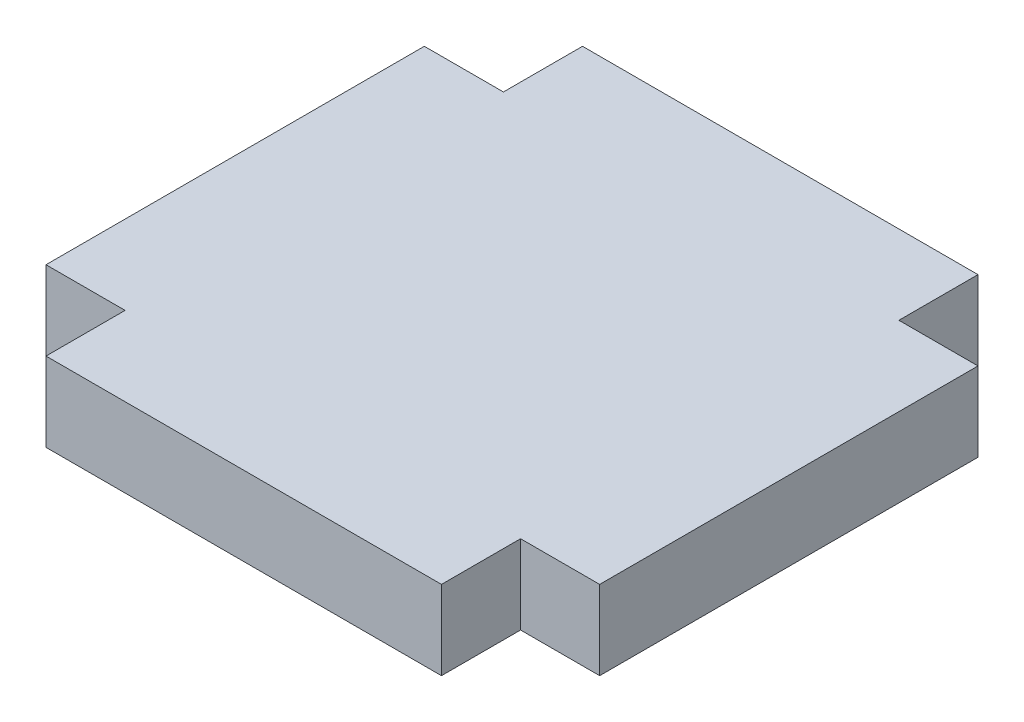
ISO-10303-21;
HEADER;
FILE_DESCRIPTION(('STEP AP214'),'2;1');
FILE_NAME('part.step','',(''),(''),'','','');
FILE_SCHEMA(('AUTOMOTIVE_DESIGN { 1 0 10303 214 1 1 1 1 }'));
ENDSEC;
DATA;
#1=APPLICATION_CONTEXT('core data for automotive mechanical design processes');
#2=APPLICATION_PROTOCOL_DEFINITION('international standard','automotive_design',2000,#1);
#3=PRODUCT_CONTEXT('',#1,'mechanical');
#4=PRODUCT('Part','Part','',(#3));
#5=PRODUCT_RELATED_PRODUCT_CATEGORY('part','',(#4));
#6=PRODUCT_DEFINITION_FORMATION('','',#4);
#7=PRODUCT_DEFINITION_CONTEXT('part definition',#1,'design');
#8=PRODUCT_DEFINITION('design','',#6,#7);
#9=PRODUCT_DEFINITION_SHAPE('','',#8);
#10=(LENGTH_UNIT() NAMED_UNIT(*) SI_UNIT(.MILLI.,.METRE.));
#11=(NAMED_UNIT(*) PLANE_ANGLE_UNIT() SI_UNIT($,.RADIAN.));
#12=(NAMED_UNIT(*) SI_UNIT($,.STERADIAN.) SOLID_ANGLE_UNIT());
#13=UNCERTAINTY_MEASURE_WITH_UNIT(LENGTH_MEASURE(1.E-05),#10,'distance_accuracy_value','');
#14=(GEOMETRIC_REPRESENTATION_CONTEXT(3) GLOBAL_UNCERTAINTY_ASSIGNED_CONTEXT((#13)) GLOBAL_UNIT_ASSIGNED_CONTEXT((#10,
#11,#12)) REPRESENTATION_CONTEXT('',''));
#15=CARTESIAN_POINT('',(0.,0.,0.));
#16=DIRECTION('',(0.,0.,1.));
#17=DIRECTION('',(1.,0.,0.));
#18=AXIS2_PLACEMENT_3D('',#15,#16,#17);
#19=CARTESIAN_POINT('',(-7.5,1.5,-7.175));
#20=DIRECTION('',(1.,0.,0.));
#21=DIRECTION('',(0.,0.,-1.));
#22=AXIS2_PLACEMENT_3D('',#19,#20,#21);
#23=PLANE('',#22);
#24=DIRECTION('',(0.,0.,1.));
#25=VECTOR('',#24,1.);
#26=CARTESIAN_POINT('',(-7.5,-1.5,-7.175));
#27=LINE('',#26,#25);
#28=CARTESIAN_POINT('',(-7.5,-1.5,-10.175));
#29=VERTEX_POINT('',#28);
#30=CARTESIAN_POINT('',(-7.5,-1.5,-7.175));
#31=VERTEX_POINT('',#30);
#32=EDGE_CURVE('E159',#29,#31,#27,.T.);
#33=ORIENTED_EDGE('',*,*,#32,.T.);
#34=DIRECTION('',(0.,-1.,0.));
#35=VECTOR('',#34,1.);
#36=CARTESIAN_POINT('',(-7.5,1.5,-7.175));
#37=LINE('',#36,#35);
#38=CARTESIAN_POINT('',(-7.5,1.5,-7.175));
#39=VERTEX_POINT('',#38);
#40=EDGE_CURVE('E11',#39,#31,#37,.T.);
#41=ORIENTED_EDGE('',*,*,#40,.F.);
#42=DIRECTION('',(0.,0.,1.));
#43=VECTOR('',#42,1.);
#44=CARTESIAN_POINT('',(-7.5,1.5,-7.175));
#45=LINE('',#44,#43);
#46=CARTESIAN_POINT('',(-7.5,1.5,-10.175));
#47=VERTEX_POINT('',#46);
#48=EDGE_CURVE('E181',#47,#39,#45,.T.);
#49=ORIENTED_EDGE('',*,*,#48,.F.);
#50=DIRECTION('',(0.,-1.,0.));
#51=VECTOR('',#50,1.);
#52=CARTESIAN_POINT('',(-7.5,1.5,-10.175));
#53=LINE('',#52,#51);
#54=EDGE_CURVE('E155',#47,#29,#53,.T.);
#55=ORIENTED_EDGE('',*,*,#54,.T.);
#56=EDGE_LOOP('',(#33,#41,#49,#55));
#57=FACE_BOUND('',#56,.T.);
#58=ADVANCED_FACE('F39',(#57),#23,.F.);
#59=CARTESIAN_POINT('',(-10.5,1.5,-7.175));
#60=DIRECTION('',(0.,0.,1.));
#61=DIRECTION('',(1.,0.,0.));
#62=AXIS2_PLACEMENT_3D('',#59,#60,#61);
#63=PLANE('',#62);
#64=DIRECTION('',(-1.,0.,0.));
#65=VECTOR('',#64,1.);
#66=CARTESIAN_POINT('',(-10.5,-1.5,-7.175));
#67=LINE('',#66,#65);
#68=CARTESIAN_POINT('',(-10.5,-1.5,-7.175));
#69=VERTEX_POINT('',#68);
#70=EDGE_CURVE('E162',#31,#69,#67,.T.);
#71=ORIENTED_EDGE('',*,*,#70,.T.);
#72=DIRECTION('',(0.,-1.,0.));
#73=VECTOR('',#72,1.);
#74=CARTESIAN_POINT('',(-10.5,1.5,-7.175));
#75=LINE('',#74,#73);
#76=CARTESIAN_POINT('',(-10.5,1.5,-7.175));
#77=VERTEX_POINT('',#76);
#78=EDGE_CURVE('E47',#77,#69,#75,.T.);
#79=ORIENTED_EDGE('',*,*,#78,.F.);
#80=DIRECTION('',(-1.,0.,0.));
#81=VECTOR('',#80,1.);
#82=CARTESIAN_POINT('',(-10.5,1.5,-7.175));
#83=LINE('',#82,#81);
#84=EDGE_CURVE('E110',#39,#77,#83,.T.);
#85=ORIENTED_EDGE('',*,*,#84,.F.);
#86=ORIENTED_EDGE('',*,*,#40,.T.);
#87=EDGE_LOOP('',(#71,#79,#85,#86));
#88=FACE_BOUND('',#87,.T.);
#89=ADVANCED_FACE('F259',(#88),#63,.F.);
#90=CARTESIAN_POINT('',(-10.5,1.5,7.175));
#91=DIRECTION('',(1.,0.,0.));
#92=DIRECTION('',(0.,0.,-1.));
#93=AXIS2_PLACEMENT_3D('',#90,#91,#92);
#94=PLANE('',#93);
#95=DIRECTION('',(0.,0.,1.));
#96=VECTOR('',#95,1.);
#97=CARTESIAN_POINT('',(-10.5,-1.5,7.175));
#98=LINE('',#97,#96);
#99=CARTESIAN_POINT('',(-10.5,-1.5,7.175));
#100=VERTEX_POINT('',#99);
#101=EDGE_CURVE('E164',#69,#100,#98,.T.);
#102=ORIENTED_EDGE('',*,*,#101,.T.);
#103=DIRECTION('',(0.,-1.,0.));
#104=VECTOR('',#103,1.);
#105=CARTESIAN_POINT('',(-10.5,1.5,7.175));
#106=LINE('',#105,#104);
#107=CARTESIAN_POINT('',(-10.5,1.5,7.175));
#108=VERTEX_POINT('',#107);
#109=EDGE_CURVE('E200',#108,#100,#106,.T.);
#110=ORIENTED_EDGE('',*,*,#109,.F.);
#111=DIRECTION('',(0.,0.,1.));
#112=VECTOR('',#111,1.);
#113=CARTESIAN_POINT('',(-10.5,1.5,7.175));
#114=LINE('',#113,#112);
#115=EDGE_CURVE('E208',#77,#108,#114,.T.);
#116=ORIENTED_EDGE('',*,*,#115,.F.);
#117=ORIENTED_EDGE('',*,*,#78,.T.);
#118=EDGE_LOOP('',(#102,#110,#116,#117));
#119=FACE_BOUND('',#118,.T.);
#120=ADVANCED_FACE('F206',(#119),#94,.F.);
#121=CARTESIAN_POINT('',(-7.5,1.5,7.175));
#122=DIRECTION('',(0.,0.,-1.));
#123=DIRECTION('',(-1.,0.,0.));
#124=AXIS2_PLACEMENT_3D('',#121,#122,#123);
#125=PLANE('',#124);
#126=DIRECTION('',(1.,0.,0.));
#127=VECTOR('',#126,1.);
#128=CARTESIAN_POINT('',(-7.5,-1.5,7.175));
#129=LINE('',#128,#127);
#130=CARTESIAN_POINT('',(-7.5,-1.5,7.175));
#131=VERTEX_POINT('',#130);
#132=EDGE_CURVE('E166',#100,#131,#129,.T.);
#133=ORIENTED_EDGE('',*,*,#132,.T.);
#134=DIRECTION('',(0.,-1.,0.));
#135=VECTOR('',#134,1.);
#136=CARTESIAN_POINT('',(-7.5,1.5,7.175));
#137=LINE('',#136,#135);
#138=CARTESIAN_POINT('',(-7.5,1.5,7.175));
#139=VERTEX_POINT('',#138);
#140=EDGE_CURVE('E197',#139,#131,#137,.T.);
#141=ORIENTED_EDGE('',*,*,#140,.F.);
#142=DIRECTION('',(1.,0.,0.));
#143=VECTOR('',#142,1.);
#144=CARTESIAN_POINT('',(-7.5,1.5,7.175));
#145=LINE('',#144,#143);
#146=EDGE_CURVE('E226',#108,#139,#145,.T.);
#147=ORIENTED_EDGE('',*,*,#146,.F.);
#148=ORIENTED_EDGE('',*,*,#109,.T.);
#149=EDGE_LOOP('',(#133,#141,#147,#148));
#150=FACE_BOUND('',#149,.T.);
#151=ADVANCED_FACE('F217',(#150),#125,.F.);
#152=CARTESIAN_POINT('',(-7.5,1.5,10.175));
#153=DIRECTION('',(1.,0.,0.));
#154=DIRECTION('',(0.,0.,-1.));
#155=AXIS2_PLACEMENT_3D('',#152,#153,#154);
#156=PLANE('',#155);
#157=DIRECTION('',(0.,0.,1.));
#158=VECTOR('',#157,1.);
#159=CARTESIAN_POINT('',(-7.5,-1.5,10.175));
#160=LINE('',#159,#158);
#161=CARTESIAN_POINT('',(-7.5,-1.5,10.175));
#162=VERTEX_POINT('',#161);
#163=EDGE_CURVE('E168',#131,#162,#160,.T.);
#164=ORIENTED_EDGE('',*,*,#163,.T.);
#165=DIRECTION('',(0.,-1.,0.));
#166=VECTOR('',#165,1.);
#167=CARTESIAN_POINT('',(-7.5,1.5,10.175));
#168=LINE('',#167,#166);
#169=CARTESIAN_POINT('',(-7.5,1.5,10.175));
#170=VERTEX_POINT('',#169);
#171=EDGE_CURVE('E194',#170,#162,#168,.T.);
#172=ORIENTED_EDGE('',*,*,#171,.F.);
#173=DIRECTION('',(0.,0.,1.));
#174=VECTOR('',#173,1.);
#175=CARTESIAN_POINT('',(-7.5,1.5,10.175));
#176=LINE('',#175,#174);
#177=EDGE_CURVE('E223',#139,#170,#176,.T.);
#178=ORIENTED_EDGE('',*,*,#177,.F.);
#179=ORIENTED_EDGE('',*,*,#140,.T.);
#180=EDGE_LOOP('',(#164,#172,#178,#179));
#181=FACE_BOUND('',#180,.T.);
#182=ADVANCED_FACE('F221',(#181),#156,.F.);
#183=CARTESIAN_POINT('',(7.5,1.5,10.175));
#184=DIRECTION('',(0.,0.,-1.));
#185=DIRECTION('',(-1.,0.,0.));
#186=AXIS2_PLACEMENT_3D('',#183,#184,#185);
#187=PLANE('',#186);
#188=DIRECTION('',(1.,0.,0.));
#189=VECTOR('',#188,1.);
#190=CARTESIAN_POINT('',(7.5,-1.5,10.175));
#191=LINE('',#190,#189);
#192=CARTESIAN_POINT('',(7.5,-1.5,10.175));
#193=VERTEX_POINT('',#192);
#194=EDGE_CURVE('E170',#162,#193,#191,.T.);
#195=ORIENTED_EDGE('',*,*,#194,.T.);
#196=DIRECTION('',(0.,-1.,0.));
#197=VECTOR('',#196,1.);
#198=CARTESIAN_POINT('',(7.5,1.5,10.175));
#199=LINE('',#198,#197);
#200=CARTESIAN_POINT('',(7.5,1.5,10.175));
#201=VERTEX_POINT('',#200);
#202=EDGE_CURVE('E191',#201,#193,#199,.T.);
#203=ORIENTED_EDGE('',*,*,#202,.F.);
#204=DIRECTION('',(1.,0.,0.));
#205=VECTOR('',#204,1.);
#206=CARTESIAN_POINT('',(7.5,1.5,10.175));
#207=LINE('',#206,#205);
#208=EDGE_CURVE('E225',#170,#201,#207,.T.);
#209=ORIENTED_EDGE('',*,*,#208,.F.);
#210=ORIENTED_EDGE('',*,*,#171,.T.);
#211=EDGE_LOOP('',(#195,#203,#209,#210));
#212=FACE_BOUND('',#211,.T.);
#213=ADVANCED_FACE('F272',(#212),#187,.F.);
#214=CARTESIAN_POINT('',(7.5,1.5,7.175));
#215=DIRECTION('',(-1.,0.,0.));
#216=DIRECTION('',(0.,0.,1.));
#217=AXIS2_PLACEMENT_3D('',#214,#215,#216);
#218=PLANE('',#217);
#219=DIRECTION('',(0.,0.,-1.));
#220=VECTOR('',#219,1.);
#221=CARTESIAN_POINT('',(7.5,-1.5,7.175));
#222=LINE('',#221,#220);
#223=CARTESIAN_POINT('',(7.5,-1.5,7.175));
#224=VERTEX_POINT('',#223);
#225=EDGE_CURVE('E172',#193,#224,#222,.T.);
#226=ORIENTED_EDGE('',*,*,#225,.T.);
#227=DIRECTION('',(0.,-1.,0.));
#228=VECTOR('',#227,1.);
#229=CARTESIAN_POINT('',(7.5,1.5,7.175));
#230=LINE('',#229,#228);
#231=CARTESIAN_POINT('',(7.5,1.5,7.175));
#232=VERTEX_POINT('',#231);
#233=EDGE_CURVE('E188',#232,#224,#230,.T.);
#234=ORIENTED_EDGE('',*,*,#233,.F.);
#235=DIRECTION('',(0.,0.,-1.));
#236=VECTOR('',#235,1.);
#237=CARTESIAN_POINT('',(7.5,1.5,7.175));
#238=LINE('',#237,#236);
#239=EDGE_CURVE('E228',#201,#232,#238,.T.);
#240=ORIENTED_EDGE('',*,*,#239,.F.);
#241=ORIENTED_EDGE('',*,*,#202,.T.);
#242=EDGE_LOOP('',(#226,#234,#240,#241));
#243=FACE_BOUND('',#242,.T.);
#244=ADVANCED_FACE('F275',(#243),#218,.F.);
#245=CARTESIAN_POINT('',(10.5,1.5,7.175));
#246=DIRECTION('',(0.,0.,-1.));
#247=DIRECTION('',(-1.,0.,0.));
#248=AXIS2_PLACEMENT_3D('',#245,#246,#247);
#249=PLANE('',#248);
#250=DIRECTION('',(1.,0.,0.));
#251=VECTOR('',#250,1.);
#252=CARTESIAN_POINT('',(10.5,-1.5,7.175));
#253=LINE('',#252,#251);
#254=CARTESIAN_POINT('',(10.5,-1.5,7.175));
#255=VERTEX_POINT('',#254);
#256=EDGE_CURVE('E174',#224,#255,#253,.T.);
#257=ORIENTED_EDGE('',*,*,#256,.T.);
#258=DIRECTION('',(0.,-1.,0.));
#259=VECTOR('',#258,1.);
#260=CARTESIAN_POINT('',(10.5,1.5,7.175));
#261=LINE('',#260,#259);
#262=CARTESIAN_POINT('',(10.5,1.5,7.175));
#263=VERTEX_POINT('',#262);
#264=EDGE_CURVE('E185',#263,#255,#261,.T.);
#265=ORIENTED_EDGE('',*,*,#264,.F.);
#266=DIRECTION('',(1.,0.,0.));
#267=VECTOR('',#266,1.);
#268=CARTESIAN_POINT('',(10.5,1.5,7.175));
#269=LINE('',#268,#267);
#270=EDGE_CURVE('E234',#232,#263,#269,.T.);
#271=ORIENTED_EDGE('',*,*,#270,.F.);
#272=ORIENTED_EDGE('',*,*,#233,.T.);
#273=EDGE_LOOP('',(#257,#265,#271,#272));
#274=FACE_BOUND('',#273,.T.);
#275=ADVANCED_FACE('F240',(#274),#249,.F.);
#276=CARTESIAN_POINT('',(10.5,1.5,-7.175));
#277=DIRECTION('',(-1.,0.,0.));
#278=DIRECTION('',(0.,0.,1.));
#279=AXIS2_PLACEMENT_3D('',#276,#277,#278);
#280=PLANE('',#279);
#281=DIRECTION('',(0.,0.,-1.));
#282=VECTOR('',#281,1.);
#283=CARTESIAN_POINT('',(10.5,-1.5,-7.175));
#284=LINE('',#283,#282);
#285=CARTESIAN_POINT('',(10.5,-1.5,-7.175));
#286=VERTEX_POINT('',#285);
#287=EDGE_CURVE('E176',#255,#286,#284,.T.);
#288=ORIENTED_EDGE('',*,*,#287,.T.);
#289=DIRECTION('',(0.,-1.,0.));
#290=VECTOR('',#289,1.);
#291=CARTESIAN_POINT('',(10.5,1.5,-7.175));
#292=LINE('',#291,#290);
#293=CARTESIAN_POINT('',(10.5,1.5,-7.175));
#294=VERTEX_POINT('',#293);
#295=EDGE_CURVE('E150',#294,#286,#292,.T.);
#296=ORIENTED_EDGE('',*,*,#295,.F.);
#297=DIRECTION('',(0.,0.,-1.));
#298=VECTOR('',#297,1.);
#299=CARTESIAN_POINT('',(10.5,1.5,-7.175));
#300=LINE('',#299,#298);
#301=EDGE_CURVE('E141',#263,#294,#300,.T.);
#302=ORIENTED_EDGE('',*,*,#301,.F.);
#303=ORIENTED_EDGE('',*,*,#264,.T.);
#304=EDGE_LOOP('',(#288,#296,#302,#303));
#305=FACE_BOUND('',#304,.T.);
#306=ADVANCED_FACE('F244',(#305),#280,.F.);
#307=CARTESIAN_POINT('',(7.5,1.5,-7.175));
#308=DIRECTION('',(0.,0.,1.));
#309=DIRECTION('',(1.,0.,0.));
#310=AXIS2_PLACEMENT_3D('',#307,#308,#309);
#311=PLANE('',#310);
#312=DIRECTION('',(-1.,0.,0.));
#313=VECTOR('',#312,1.);
#314=CARTESIAN_POINT('',(7.5,-1.5,-7.175));
#315=LINE('',#314,#313);
#316=CARTESIAN_POINT('',(7.5,-1.5,-7.175));
#317=VERTEX_POINT('',#316);
#318=EDGE_CURVE('E149',#286,#317,#315,.T.);
#319=ORIENTED_EDGE('',*,*,#318,.T.);
#320=DIRECTION('',(0.,-1.,0.));
#321=VECTOR('',#320,1.);
#322=CARTESIAN_POINT('',(7.5,1.5,-7.175));
#323=LINE('',#322,#321);
#324=CARTESIAN_POINT('',(7.5,1.5,-7.175));
#325=VERTEX_POINT('',#324);
#326=EDGE_CURVE('E146',#325,#317,#323,.T.);
#327=ORIENTED_EDGE('',*,*,#326,.F.);
#328=DIRECTION('',(-1.,0.,0.));
#329=VECTOR('',#328,1.);
#330=CARTESIAN_POINT('',(7.5,1.5,-7.175));
#331=LINE('',#330,#329);
#332=EDGE_CURVE('E135',#294,#325,#331,.T.);
#333=ORIENTED_EDGE('',*,*,#332,.F.);
#334=ORIENTED_EDGE('',*,*,#295,.T.);
#335=EDGE_LOOP('',(#319,#327,#333,#334));
#336=FACE_BOUND('',#335,.T.);
#337=ADVANCED_FACE('F147',(#336),#311,.F.);
#338=CARTESIAN_POINT('',(7.5,1.5,-10.175));
#339=DIRECTION('',(-1.,0.,0.));
#340=DIRECTION('',(0.,0.,1.));
#341=AXIS2_PLACEMENT_3D('',#338,#339,#340);
#342=PLANE('',#341);
#343=DIRECTION('',(0.,0.,-1.));
#344=VECTOR('',#343,1.);
#345=CARTESIAN_POINT('',(7.5,-1.5,-10.175));
#346=LINE('',#345,#344);
#347=CARTESIAN_POINT('',(7.5,-1.5,-10.175));
#348=VERTEX_POINT('',#347);
#349=EDGE_CURVE('E96',#317,#348,#346,.T.);
#350=ORIENTED_EDGE('',*,*,#349,.T.);
#351=DIRECTION('',(0.,-1.,0.));
#352=VECTOR('',#351,1.);
#353=CARTESIAN_POINT('',(7.5,1.5,-10.175));
#354=LINE('',#353,#352);
#355=CARTESIAN_POINT('',(7.5,1.5,-10.175));
#356=VERTEX_POINT('',#355);
#357=EDGE_CURVE('E151',#356,#348,#354,.T.);
#358=ORIENTED_EDGE('',*,*,#357,.F.);
#359=DIRECTION('',(0.,0.,-1.));
#360=VECTOR('',#359,1.);
#361=CARTESIAN_POINT('',(7.5,1.5,-10.175));
#362=LINE('',#361,#360);
#363=EDGE_CURVE('E139',#325,#356,#362,.T.);
#364=ORIENTED_EDGE('',*,*,#363,.F.);
#365=ORIENTED_EDGE('',*,*,#326,.T.);
#366=EDGE_LOOP('',(#350,#358,#364,#365));
#367=FACE_BOUND('',#366,.T.);
#368=ADVANCED_FACE('F153',(#367),#342,.F.);
#369=CARTESIAN_POINT('',(-7.5,1.5,-10.175));
#370=DIRECTION('',(0.,0.,1.));
#371=DIRECTION('',(1.,0.,0.));
#372=AXIS2_PLACEMENT_3D('',#369,#370,#371);
#373=PLANE('',#372);
#374=DIRECTION('',(-1.,0.,0.));
#375=VECTOR('',#374,1.);
#376=CARTESIAN_POINT('',(-7.5,-1.5,-10.175));
#377=LINE('',#376,#375);
#378=EDGE_CURVE('E102',#348,#29,#377,.T.);
#379=ORIENTED_EDGE('',*,*,#378,.T.);
#380=ORIENTED_EDGE('',*,*,#54,.F.);
#381=DIRECTION('',(-1.,0.,0.));
#382=VECTOR('',#381,1.);
#383=CARTESIAN_POINT('',(-7.5,1.5,-10.175));
#384=LINE('',#383,#382);
#385=EDGE_CURVE('E55',#356,#47,#384,.T.);
#386=ORIENTED_EDGE('',*,*,#385,.F.);
#387=ORIENTED_EDGE('',*,*,#357,.T.);
#388=EDGE_LOOP('',(#379,#380,#386,#387));
#389=FACE_BOUND('',#388,.T.);
#390=ADVANCED_FACE('F248',(#389),#373,.F.);
#391=CARTESIAN_POINT('',(0.,1.5,0.));
#392=DIRECTION('',(0.,-1.,0.));
#393=DIRECTION('',(0.,0.,-1.));
#394=AXIS2_PLACEMENT_3D('',#391,#392,#393);
#395=PLANE('',#394);
#396=ORIENTED_EDGE('',*,*,#48,.T.);
#397=ORIENTED_EDGE('',*,*,#84,.T.);
#398=ORIENTED_EDGE('',*,*,#115,.T.);
#399=ORIENTED_EDGE('',*,*,#146,.T.);
#400=ORIENTED_EDGE('',*,*,#177,.T.);
#401=ORIENTED_EDGE('',*,*,#208,.T.);
#402=ORIENTED_EDGE('',*,*,#239,.T.);
#403=ORIENTED_EDGE('',*,*,#270,.T.);
#404=ORIENTED_EDGE('',*,*,#301,.T.);
#405=ORIENTED_EDGE('',*,*,#332,.T.);
#406=ORIENTED_EDGE('',*,*,#363,.T.);
#407=ORIENTED_EDGE('',*,*,#385,.T.);
#408=EDGE_LOOP('',(#396,#397,#398,#399,#400,#401,#402,#403,#404,#405,#406,#407));
#409=FACE_BOUND('',#408,.T.);
#410=ADVANCED_FACE('F137',(#409),#395,.F.);
#411=CARTESIAN_POINT('',(0.,-1.5,0.));
#412=DIRECTION('',(0.,-1.,0.));
#413=DIRECTION('',(0.,0.,-1.));
#414=AXIS2_PLACEMENT_3D('',#411,#412,#413);
#415=PLANE('',#414);
#416=ORIENTED_EDGE('',*,*,#32,.F.);
#417=ORIENTED_EDGE('',*,*,#378,.F.);
#418=ORIENTED_EDGE('',*,*,#349,.F.);
#419=ORIENTED_EDGE('',*,*,#318,.F.);
#420=ORIENTED_EDGE('',*,*,#287,.F.);
#421=ORIENTED_EDGE('',*,*,#256,.F.);
#422=ORIENTED_EDGE('',*,*,#225,.F.);
#423=ORIENTED_EDGE('',*,*,#194,.F.);
#424=ORIENTED_EDGE('',*,*,#163,.F.);
#425=ORIENTED_EDGE('',*,*,#132,.F.);
#426=ORIENTED_EDGE('',*,*,#101,.F.);
#427=ORIENTED_EDGE('',*,*,#70,.F.);
#428=EDGE_LOOP('',(#416,#417,#418,#419,#420,#421,#422,#423,#424,#425,#426,#427));
#429=FACE_BOUND('',#428,.T.);
#430=ADVANCED_FACE('F212',(#429),#415,.T.);
#431=CLOSED_SHELL('',(#58,#89,#120,#151,#182,#213,#244,#275,#306,#337,#368,#390,#410,#430));
#432=MANIFOLD_SOLID_BREP('B2',#431);
#433=ADVANCED_BREP_SHAPE_REPRESENTATION('',(#18,#432),#14);
#434=SHAPE_DEFINITION_REPRESENTATION(#9,#433);
ENDSEC;
END-ISO-10303-21;
